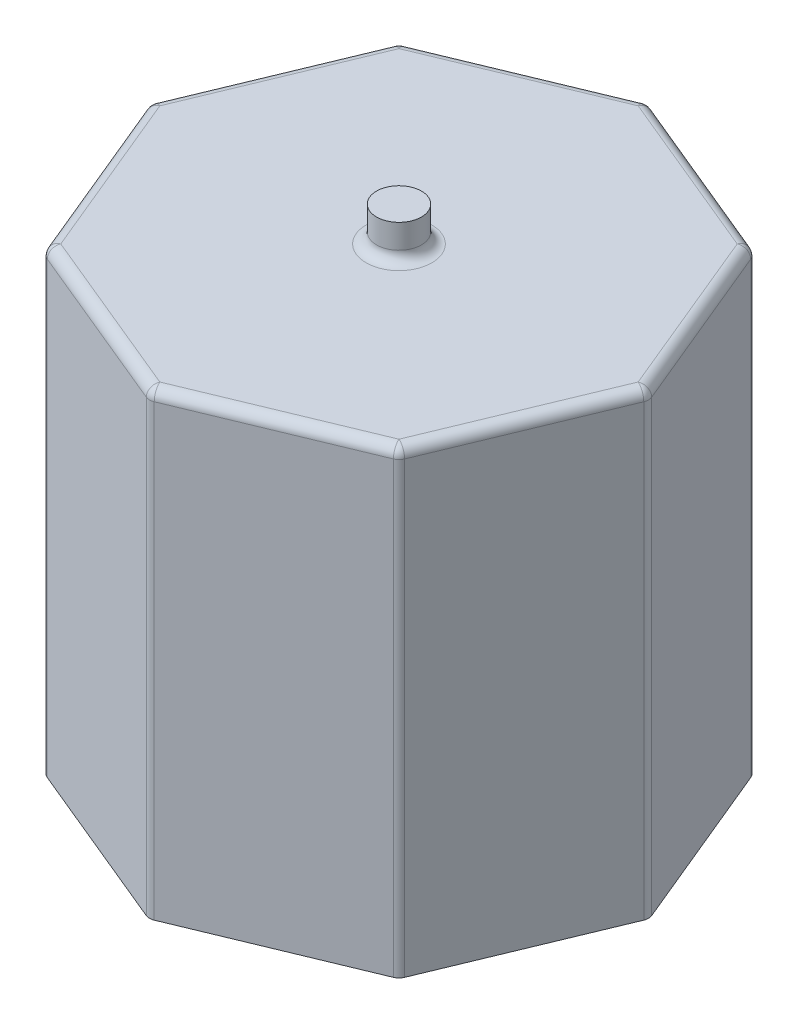
ISO-10303-21;
HEADER;
FILE_DESCRIPTION(('STEP AP214'),'2;1');
FILE_NAME('part.step','',(''),(''),'','','');
FILE_SCHEMA(('AUTOMOTIVE_DESIGN { 1 0 10303 214 1 1 1 1 }'));
ENDSEC;
DATA;
#1=APPLICATION_CONTEXT('core data for automotive mechanical design processes');
#2=APPLICATION_PROTOCOL_DEFINITION('international standard','automotive_design',2000,#1);
#3=PRODUCT_CONTEXT('',#1,'mechanical');
#4=PRODUCT('Part','Part','',(#3));
#5=PRODUCT_RELATED_PRODUCT_CATEGORY('part','',(#4));
#6=PRODUCT_DEFINITION_FORMATION('','',#4);
#7=PRODUCT_DEFINITION_CONTEXT('part definition',#1,'design');
#8=PRODUCT_DEFINITION('design','',#6,#7);
#9=PRODUCT_DEFINITION_SHAPE('','',#8);
#10=(LENGTH_UNIT() NAMED_UNIT(*) SI_UNIT(.MILLI.,.METRE.));
#11=(NAMED_UNIT(*) PLANE_ANGLE_UNIT() SI_UNIT($,.RADIAN.));
#12=(NAMED_UNIT(*) SI_UNIT($,.STERADIAN.) SOLID_ANGLE_UNIT());
#13=UNCERTAINTY_MEASURE_WITH_UNIT(LENGTH_MEASURE(1.E-05),#10,'distance_accuracy_value','');
#14=(GEOMETRIC_REPRESENTATION_CONTEXT(3) GLOBAL_UNCERTAINTY_ASSIGNED_CONTEXT((#13)) GLOBAL_UNIT_ASSIGNED_CONTEXT((#10,
#11,#12)) REPRESENTATION_CONTEXT('',''));
#15=CARTESIAN_POINT('',(0.,0.,0.));
#16=DIRECTION('',(0.,0.,1.));
#17=DIRECTION('',(1.,0.,0.));
#18=AXIS2_PLACEMENT_3D('',#15,#16,#17);
#19=CARTESIAN_POINT('',(5.12652416360253,13.3,5.12652416360241));
#20=DIRECTION('',(-0.923879532511291,0.,-0.382683432365079));
#21=DIRECTION('',(-0.382683432365079,0.,0.923879532511292));
#22=AXIS2_PLACEMENT_3D('',#19,#20,#21);
#23=PLANE('',#22);
#24=DIRECTION('',(0.,-1.,0.));
#25=VECTOR('',#24,1.);
#26=CARTESIAN_POINT('',(7.20244619966567,13.3,0.114805029709439));
#27=LINE('',#26,#25);
#28=CARTESIAN_POINT('',(7.20244619966567,0.,0.11480502970944));
#29=VERTEX_POINT('',#28);
#30=CARTESIAN_POINT('',(7.20244619966567,13.,0.114805029709439));
#31=VERTEX_POINT('',#30);
#32=EDGE_CURVE('E247',#29,#31,#27,.F.);
#33=ORIENTED_EDGE('',*,*,#32,.T.);
#34=DIRECTION('',(0.382683432365079,0.,-0.923879532511292));
#35=VECTOR('',#34,1.);
#36=CARTESIAN_POINT('',(5.17407796393686,13.,5.01171913389288));
#37=LINE('',#36,#35);
#38=CARTESIAN_POINT('',(5.17407796393686,13.,5.01171913389288));
#39=VERTEX_POINT('',#38);
#40=EDGE_CURVE('E278',#31,#39,#37,.F.);
#41=ORIENTED_EDGE('',*,*,#40,.T.);
#42=DIRECTION('',(0.,-1.,0.));
#43=VECTOR('',#42,1.);
#44=CARTESIAN_POINT('',(5.17407796393686,13.3,5.01171913389288));
#45=LINE('',#44,#43);
#46=CARTESIAN_POINT('',(5.17407796393686,0.,5.01171913389288));
#47=VERTEX_POINT('',#46);
#48=EDGE_CURVE('E245',#39,#47,#45,.T.);
#49=ORIENTED_EDGE('',*,*,#48,.T.);
#50=DIRECTION('',(0.382683432365079,0.,-0.923879532511291));
#51=VECTOR('',#50,1.);
#52=CARTESIAN_POINT('',(5.12652416360253,0.,5.12652416360241));
#53=LINE('',#52,#51);
#54=EDGE_CURVE('E357',#47,#29,#53,.T.);
#55=ORIENTED_EDGE('',*,*,#54,.T.);
#56=EDGE_LOOP('',(#33,#41,#49,#55));
#57=FACE_BOUND('',#56,.T.);
#58=ADVANCED_FACE('F35',(#57),#23,.F.);
#59=CARTESIAN_POINT('',(7.25,13.3,0.));
#60=DIRECTION('',(-0.923879532511282,0.,0.382683432365101));
#61=DIRECTION('',(0.382683432365101,0.,0.923879532511282));
#62=AXIS2_PLACEMENT_3D('',#59,#60,#61);
#63=PLANE('',#62);
#64=DIRECTION('',(0.,-1.,0.));
#65=VECTOR('',#64,1.);
#66=CARTESIAN_POINT('',(5.17407796393674,13.3,-5.01171913389301));
#67=LINE('',#66,#65);
#68=CARTESIAN_POINT('',(5.17407796393674,0.,-5.011719133893));
#69=VERTEX_POINT('',#68);
#70=CARTESIAN_POINT('',(5.17407796393674,13.,-5.01171913389301));
#71=VERTEX_POINT('',#70);
#72=EDGE_CURVE('E243',#69,#71,#67,.F.);
#73=ORIENTED_EDGE('',*,*,#72,.T.);
#74=DIRECTION('',(-0.382683432365101,0.,-0.923879532511282));
#75=VECTOR('',#74,1.);
#76=CARTESIAN_POINT('',(7.20244619966567,13.,-0.114805029709614));
#77=LINE('',#76,#75);
#78=CARTESIAN_POINT('',(7.20244619966567,13.,-0.114805029709615));
#79=VERTEX_POINT('',#78);
#80=EDGE_CURVE('E11',#71,#79,#77,.F.);
#81=ORIENTED_EDGE('',*,*,#80,.T.);
#82=DIRECTION('',(0.,-1.,0.));
#83=VECTOR('',#82,1.);
#84=CARTESIAN_POINT('',(7.20244619966567,13.3,-0.114805029709615));
#85=LINE('',#84,#83);
#86=CARTESIAN_POINT('',(7.20244619966567,0.,-0.114805029709615));
#87=VERTEX_POINT('',#86);
#88=EDGE_CURVE('E241',#79,#87,#85,.T.);
#89=ORIENTED_EDGE('',*,*,#88,.T.);
#90=DIRECTION('',(-0.382683432365101,0.,-0.923879532511282));
#91=VECTOR('',#90,1.);
#92=CARTESIAN_POINT('',(7.25,0.,0.));
#93=LINE('',#92,#91);
#94=EDGE_CURVE('E362',#87,#69,#93,.T.);
#95=ORIENTED_EDGE('',*,*,#94,.T.);
#96=EDGE_LOOP('',(#73,#81,#89,#95));
#97=FACE_BOUND('',#96,.T.);
#98=ADVANCED_FACE('F411',(#97),#63,.F.);
#99=CARTESIAN_POINT('',(5.12652416360241,13.3,-5.12652416360253));
#100=DIRECTION('',(-0.382683432365078,0.,0.923879532511291));
#101=DIRECTION('',(0.923879532511291,0.,0.382683432365078));
#102=AXIS2_PLACEMENT_3D('',#99,#100,#101);
#103=PLANE('',#102);
#104=DIRECTION('',(0.,-1.,0.));
#105=VECTOR('',#104,1.);
#106=CARTESIAN_POINT('',(0.114805029709439,13.3,-7.20244619966567));
#107=LINE('',#106,#105);
#108=CARTESIAN_POINT('',(0.114805029709439,0.,-7.20244619966567));
#109=VERTEX_POINT('',#108);
#110=CARTESIAN_POINT('',(0.114805029709439,13.,-7.20244619966567));
#111=VERTEX_POINT('',#110);
#112=EDGE_CURVE('E239',#109,#111,#107,.F.);
#113=ORIENTED_EDGE('',*,*,#112,.T.);
#114=DIRECTION('',(-0.923879532511291,0.,-0.382683432365078));
#115=VECTOR('',#114,1.);
#116=CARTESIAN_POINT('',(5.01171913389288,13.,-5.17407796393686));
#117=LINE('',#116,#115);
#118=CARTESIAN_POINT('',(5.01171913389288,13.,-5.17407796393686));
#119=VERTEX_POINT('',#118);
#120=EDGE_CURVE('E60',#111,#119,#117,.F.);
#121=ORIENTED_EDGE('',*,*,#120,.T.);
#122=DIRECTION('',(0.,-1.,0.));
#123=VECTOR('',#122,1.);
#124=CARTESIAN_POINT('',(5.01171913389288,13.3,-5.17407796393686));
#125=LINE('',#124,#123);
#126=CARTESIAN_POINT('',(5.01171913389288,0.,-5.17407796393686));
#127=VERTEX_POINT('',#126);
#128=EDGE_CURVE('E237',#119,#127,#125,.T.);
#129=ORIENTED_EDGE('',*,*,#128,.T.);
#130=DIRECTION('',(-0.923879532511291,0.,-0.382683432365078));
#131=VECTOR('',#130,1.);
#132=CARTESIAN_POINT('',(5.12652416360241,0.,-5.12652416360253));
#133=LINE('',#132,#131);
#134=EDGE_CURVE('E367',#127,#109,#133,.T.);
#135=ORIENTED_EDGE('',*,*,#134,.T.);
#136=EDGE_LOOP('',(#113,#121,#129,#135));
#137=FACE_BOUND('',#136,.T.);
#138=ADVANCED_FACE('F404',(#137),#103,.F.);
#139=CARTESIAN_POINT('',(0.,13.3,-7.25));
#140=DIRECTION('',(0.382683432365101,0.,0.923879532511282));
#141=DIRECTION('',(0.923879532511282,0.,-0.382683432365101));
#142=AXIS2_PLACEMENT_3D('',#139,#140,#141);
#143=PLANE('',#142);
#144=DIRECTION('',(0.,-1.,0.));
#145=VECTOR('',#144,1.);
#146=CARTESIAN_POINT('',(-5.011719133893,13.3,-5.17407796393674));
#147=LINE('',#146,#145);
#148=CARTESIAN_POINT('',(-5.011719133893,0.,-5.17407796393674));
#149=VERTEX_POINT('',#148);
#150=CARTESIAN_POINT('',(-5.011719133893,13.,-5.17407796393674));
#151=VERTEX_POINT('',#150);
#152=EDGE_CURVE('E234',#149,#151,#147,.F.);
#153=ORIENTED_EDGE('',*,*,#152,.T.);
#154=DIRECTION('',(-0.923879532511282,0.,0.382683432365101));
#155=VECTOR('',#154,1.);
#156=CARTESIAN_POINT('',(-0.114805029709614,13.,-7.20244619966567));
#157=LINE('',#156,#155);
#158=CARTESIAN_POINT('',(-0.114805029709615,13.,-7.20244619966567));
#159=VERTEX_POINT('',#158);
#160=EDGE_CURVE('E297',#151,#159,#157,.F.);
#161=ORIENTED_EDGE('',*,*,#160,.T.);
#162=DIRECTION('',(0.,-1.,0.));
#163=VECTOR('',#162,1.);
#164=CARTESIAN_POINT('',(-0.114805029709615,13.3,-7.20244619966567));
#165=LINE('',#164,#163);
#166=CARTESIAN_POINT('',(-0.114805029709615,0.,-7.20244619966567));
#167=VERTEX_POINT('',#166);
#168=EDGE_CURVE('E232',#159,#167,#165,.T.);
#169=ORIENTED_EDGE('',*,*,#168,.T.);
#170=DIRECTION('',(-0.923879532511282,0.,0.382683432365101));
#171=VECTOR('',#170,1.);
#172=CARTESIAN_POINT('',(0.,0.,-7.25));
#173=LINE('',#172,#171);
#174=EDGE_CURVE('E370',#167,#149,#173,.T.);
#175=ORIENTED_EDGE('',*,*,#174,.T.);
#176=EDGE_LOOP('',(#153,#161,#169,#175));
#177=FACE_BOUND('',#176,.T.);
#178=ADVANCED_FACE('F394',(#177),#143,.F.);
#179=CARTESIAN_POINT('',(-5.12652416360253,13.3,-5.12652416360241));
#180=DIRECTION('',(0.923879532511291,0.,0.382683432365079));
#181=DIRECTION('',(0.382683432365079,0.,-0.923879532511291));
#182=AXIS2_PLACEMENT_3D('',#179,#180,#181);
#183=PLANE('',#182);
#184=DIRECTION('',(0.,-1.,0.));
#185=VECTOR('',#184,1.);
#186=CARTESIAN_POINT('',(-7.20244619966567,13.3,-0.11480502970944));
#187=LINE('',#186,#185);
#188=CARTESIAN_POINT('',(-7.20244619966567,0.,-0.11480502970944));
#189=VERTEX_POINT('',#188);
#190=CARTESIAN_POINT('',(-7.20244619966567,13.,-0.11480502970944));
#191=VERTEX_POINT('',#190);
#192=EDGE_CURVE('E229',#189,#191,#187,.F.);
#193=ORIENTED_EDGE('',*,*,#192,.T.);
#194=DIRECTION('',(-0.382683432365079,0.,0.923879532511291));
#195=VECTOR('',#194,1.);
#196=CARTESIAN_POINT('',(-5.17407796393686,13.,-5.01171913389288));
#197=LINE('',#196,#195);
#198=CARTESIAN_POINT('',(-5.17407796393686,13.,-5.01171913389288));
#199=VERTEX_POINT('',#198);
#200=EDGE_CURVE('E293',#191,#199,#197,.F.);
#201=ORIENTED_EDGE('',*,*,#200,.T.);
#202=DIRECTION('',(0.,-1.,0.));
#203=VECTOR('',#202,1.);
#204=CARTESIAN_POINT('',(-5.17407796393686,13.3,-5.01171913389288));
#205=LINE('',#204,#203);
#206=CARTESIAN_POINT('',(-5.17407796393686,0.,-5.01171913389288));
#207=VERTEX_POINT('',#206);
#208=EDGE_CURVE('E227',#199,#207,#205,.T.);
#209=ORIENTED_EDGE('',*,*,#208,.T.);
#210=DIRECTION('',(-0.382683432365079,0.,0.923879532511291));
#211=VECTOR('',#210,1.);
#212=CARTESIAN_POINT('',(-5.12652416360253,0.,-5.12652416360241));
#213=LINE('',#212,#211);
#214=EDGE_CURVE('E208',#207,#189,#213,.T.);
#215=ORIENTED_EDGE('',*,*,#214,.T.);
#216=EDGE_LOOP('',(#193,#201,#209,#215));
#217=FACE_BOUND('',#216,.T.);
#218=ADVANCED_FACE('F376',(#217),#183,.F.);
#219=CARTESIAN_POINT('',(-7.25,13.3,0.));
#220=DIRECTION('',(0.923879532511282,0.,-0.382683432365101));
#221=DIRECTION('',(-0.382683432365101,0.,-0.923879532511282));
#222=AXIS2_PLACEMENT_3D('',#219,#220,#221);
#223=PLANE('',#222);
#224=DIRECTION('',(0.,-1.,0.));
#225=VECTOR('',#224,1.);
#226=CARTESIAN_POINT('',(-5.17407796393674,13.3,5.011719133893));
#227=LINE('',#226,#225);
#228=CARTESIAN_POINT('',(-5.17407796393674,0.,5.011719133893));
#229=VERTEX_POINT('',#228);
#230=CARTESIAN_POINT('',(-5.17407796393674,13.,5.011719133893));
#231=VERTEX_POINT('',#230);
#232=EDGE_CURVE('E193',#229,#231,#227,.F.);
#233=ORIENTED_EDGE('',*,*,#232,.T.);
#234=DIRECTION('',(0.382683432365101,0.,0.923879532511282));
#235=VECTOR('',#234,1.);
#236=CARTESIAN_POINT('',(-7.20244619966567,13.,0.114805029709614));
#237=LINE('',#236,#235);
#238=CARTESIAN_POINT('',(-7.20244619966567,13.,0.114805029709614));
#239=VERTEX_POINT('',#238);
#240=EDGE_CURVE('E289',#231,#239,#237,.F.);
#241=ORIENTED_EDGE('',*,*,#240,.T.);
#242=DIRECTION('',(0.,-1.,0.));
#243=VECTOR('',#242,1.);
#244=CARTESIAN_POINT('',(-7.20244619966567,13.3,0.114805029709614));
#245=LINE('',#244,#243);
#246=CARTESIAN_POINT('',(-7.20244619966567,0.,0.114805029709614));
#247=VERTEX_POINT('',#246);
#248=EDGE_CURVE('E197',#239,#247,#245,.T.);
#249=ORIENTED_EDGE('',*,*,#248,.T.);
#250=DIRECTION('',(0.382683432365101,0.,0.923879532511282));
#251=VECTOR('',#250,1.);
#252=CARTESIAN_POINT('',(-7.25,0.,0.));
#253=LINE('',#252,#251);
#254=EDGE_CURVE('E204',#247,#229,#253,.T.);
#255=ORIENTED_EDGE('',*,*,#254,.T.);
#256=EDGE_LOOP('',(#233,#241,#249,#255));
#257=FACE_BOUND('',#256,.T.);
#258=ADVANCED_FACE('F457',(#257),#223,.F.);
#259=CARTESIAN_POINT('',(-5.12652416360241,13.3,5.12652416360253));
#260=DIRECTION('',(0.382683432365079,0.,-0.923879532511291));
#261=DIRECTION('',(-0.923879532511291,0.,-0.382683432365079));
#262=AXIS2_PLACEMENT_3D('',#259,#260,#261);
#263=PLANE('',#262);
#264=DIRECTION('',(0.,-1.,0.));
#265=VECTOR('',#264,1.);
#266=CARTESIAN_POINT('',(-0.114805029709441,13.3,7.20244619966567));
#267=LINE('',#266,#265);
#268=CARTESIAN_POINT('',(-0.114805029709441,0.,7.20244619966567));
#269=VERTEX_POINT('',#268);
#270=CARTESIAN_POINT('',(-0.114805029709441,13.,7.20244619966567));
#271=VERTEX_POINT('',#270);
#272=EDGE_CURVE('E187',#269,#271,#267,.F.);
#273=ORIENTED_EDGE('',*,*,#272,.T.);
#274=DIRECTION('',(0.923879532511291,0.,0.382683432365079));
#275=VECTOR('',#274,1.);
#276=CARTESIAN_POINT('',(-5.01171913389288,13.,5.17407796393686));
#277=LINE('',#276,#275);
#278=CARTESIAN_POINT('',(-5.01171913389288,13.,5.17407796393686));
#279=VERTEX_POINT('',#278);
#280=EDGE_CURVE('E183',#271,#279,#277,.F.);
#281=ORIENTED_EDGE('',*,*,#280,.T.);
#282=DIRECTION('',(0.,-1.,0.));
#283=VECTOR('',#282,1.);
#284=CARTESIAN_POINT('',(-5.01171913389288,13.3,5.17407796393686));
#285=LINE('',#284,#283);
#286=CARTESIAN_POINT('',(-5.01171913389288,0.,5.17407796393686));
#287=VERTEX_POINT('',#286);
#288=EDGE_CURVE('E175',#279,#287,#285,.T.);
#289=ORIENTED_EDGE('',*,*,#288,.T.);
#290=DIRECTION('',(0.923879532511291,0.,0.382683432365079));
#291=VECTOR('',#290,1.);
#292=CARTESIAN_POINT('',(-5.12652416360241,0.,5.12652416360253));
#293=LINE('',#292,#291);
#294=EDGE_CURVE('E180',#287,#269,#293,.T.);
#295=ORIENTED_EDGE('',*,*,#294,.T.);
#296=EDGE_LOOP('',(#273,#281,#289,#295));
#297=FACE_BOUND('',#296,.T.);
#298=ADVANCED_FACE('F178',(#297),#263,.F.);
#299=CARTESIAN_POINT('',(0.,13.3,7.25));
#300=DIRECTION('',(-0.382683432365101,0.,-0.923879532511282));
#301=DIRECTION('',(-0.923879532511282,0.,0.382683432365101));
#302=AXIS2_PLACEMENT_3D('',#299,#300,#301);
#303=PLANE('',#302);
#304=DIRECTION('',(0.,-1.,0.));
#305=VECTOR('',#304,1.);
#306=CARTESIAN_POINT('',(5.011719133893,13.3,5.17407796393674));
#307=LINE('',#306,#305);
#308=CARTESIAN_POINT('',(5.011719133893,0.,5.17407796393674));
#309=VERTEX_POINT('',#308);
#310=CARTESIAN_POINT('',(5.011719133893,13.,5.17407796393674));
#311=VERTEX_POINT('',#310);
#312=EDGE_CURVE('E252',#309,#311,#307,.F.);
#313=ORIENTED_EDGE('',*,*,#312,.T.);
#314=DIRECTION('',(0.923879532511282,0.,-0.382683432365101));
#315=VECTOR('',#314,1.);
#316=CARTESIAN_POINT('',(0.114805029709614,13.,7.20244619966567));
#317=LINE('',#316,#315);
#318=CARTESIAN_POINT('',(0.114805029709614,13.,7.20244619966567));
#319=VERTEX_POINT('',#318);
#320=EDGE_CURVE('E282',#311,#319,#317,.F.);
#321=ORIENTED_EDGE('',*,*,#320,.T.);
#322=DIRECTION('',(0.,-1.,0.));
#323=VECTOR('',#322,1.);
#324=CARTESIAN_POINT('',(0.114805029709614,13.3,7.20244619966567));
#325=LINE('',#324,#323);
#326=CARTESIAN_POINT('',(0.114805029709614,0.,7.20244619966567));
#327=VERTEX_POINT('',#326);
#328=EDGE_CURVE('E250',#319,#327,#325,.T.);
#329=ORIENTED_EDGE('',*,*,#328,.T.);
#330=DIRECTION('',(0.923879532511282,0.,-0.382683432365101));
#331=VECTOR('',#330,1.);
#332=CARTESIAN_POINT('',(0.,0.,7.25));
#333=LINE('',#332,#331);
#334=EDGE_CURVE('E203',#327,#309,#333,.T.);
#335=ORIENTED_EDGE('',*,*,#334,.T.);
#336=EDGE_LOOP('',(#313,#321,#329,#335));
#337=FACE_BOUND('',#336,.T.);
#338=ADVANCED_FACE('F430',(#337),#303,.F.);
#339=CARTESIAN_POINT('',(0.,13.3,0.));
#340=DIRECTION('',(0.,1.,0.));
#341=DIRECTION('',(0.,0.,1.));
#342=AXIS2_PLACEMENT_3D('',#339,#340,#341);
#343=PLANE('',#342);
#344=CARTESIAN_POINT('',(0.,13.3,0.));
#345=DIRECTION('',(0.,1.,0.));
#346=DIRECTION('',(0.,0.,1.));
#347=AXIS2_PLACEMENT_3D('',#344,#345,#346);
#348=CIRCLE('',#347,0.95);
#349=CARTESIAN_POINT('',(0.,13.3,0.95));
#350=VERTEX_POINT('',#349);
#351=EDGE_CURVE('E275',#350,#350,#348,.F.);
#352=ORIENTED_EDGE('',*,*,#351,.T.);
#353=EDGE_LOOP('',(#352));
#354=FACE_BOUND('',#353,.T.);
#355=DIRECTION('',(0.923879532511282,0.,-0.382683432365101));
#356=VECTOR('',#355,1.);
#357=CARTESIAN_POINT('',(4.89691410418347,13.3,4.89691410418336));
#358=LINE('',#357,#356);
#359=CARTESIAN_POINT('',(0.,13.3,6.92528233991228));
#360=VERTEX_POINT('',#359);
#361=CARTESIAN_POINT('',(4.89691410418347,13.3,4.89691410418336));
#362=VERTEX_POINT('',#361);
#363=EDGE_CURVE('E270',#360,#362,#358,.T.);
#364=ORIENTED_EDGE('',*,*,#363,.T.);
#365=DIRECTION('',(0.382683432365079,0.,-0.923879532511292));
#366=VECTOR('',#365,1.);
#367=CARTESIAN_POINT('',(6.92528233991228,13.3,0.));
#368=LINE('',#367,#366);
#369=CARTESIAN_POINT('',(6.92528233991228,13.3,0.));
#370=VERTEX_POINT('',#369);
#371=EDGE_CURVE('E272',#362,#370,#368,.T.);
#372=ORIENTED_EDGE('',*,*,#371,.T.);
#373=DIRECTION('',(-0.382683432365101,0.,-0.923879532511282));
#374=VECTOR('',#373,1.);
#375=CARTESIAN_POINT('',(4.89691410418336,13.3,-4.89691410418347));
#376=LINE('',#375,#374);
#377=CARTESIAN_POINT('',(4.89691410418336,13.3,-4.89691410418347));
#378=VERTEX_POINT('',#377);
#379=EDGE_CURVE('E258',#370,#378,#376,.T.);
#380=ORIENTED_EDGE('',*,*,#379,.T.);
#381=DIRECTION('',(-0.923879532511291,0.,-0.382683432365078));
#382=VECTOR('',#381,1.);
#383=CARTESIAN_POINT('',(0.,13.3,-6.92528233991228));
#384=LINE('',#383,#382);
#385=CARTESIAN_POINT('',(0.,13.3,-6.92528233991228));
#386=VERTEX_POINT('',#385);
#387=EDGE_CURVE('E260',#378,#386,#384,.T.);
#388=ORIENTED_EDGE('',*,*,#387,.T.);
#389=DIRECTION('',(-0.923879532511282,0.,0.382683432365101));
#390=VECTOR('',#389,1.);
#391=CARTESIAN_POINT('',(-4.89691410418347,13.3,-4.89691410418336));
#392=LINE('',#391,#390);
#393=CARTESIAN_POINT('',(-4.89691410418347,13.3,-4.89691410418336));
#394=VERTEX_POINT('',#393);
#395=EDGE_CURVE('E262',#386,#394,#392,.T.);
#396=ORIENTED_EDGE('',*,*,#395,.T.);
#397=DIRECTION('',(-0.382683432365079,0.,0.923879532511291));
#398=VECTOR('',#397,1.);
#399=CARTESIAN_POINT('',(-6.92528233991228,13.3,0.));
#400=LINE('',#399,#398);
#401=CARTESIAN_POINT('',(-6.92528233991228,13.3,0.));
#402=VERTEX_POINT('',#401);
#403=EDGE_CURVE('E264',#394,#402,#400,.T.);
#404=ORIENTED_EDGE('',*,*,#403,.T.);
#405=DIRECTION('',(0.382683432365101,0.,0.923879532511282));
#406=VECTOR('',#405,1.);
#407=CARTESIAN_POINT('',(-4.89691410418336,13.3,4.89691410418347));
#408=LINE('',#407,#406);
#409=CARTESIAN_POINT('',(-4.89691410418336,13.3,4.89691410418347));
#410=VERTEX_POINT('',#409);
#411=EDGE_CURVE('E266',#402,#410,#408,.T.);
#412=ORIENTED_EDGE('',*,*,#411,.T.);
#413=DIRECTION('',(0.923879532511291,0.,0.382683432365079));
#414=VECTOR('',#413,1.);
#415=CARTESIAN_POINT('',(0.,13.3,6.92528233991228));
#416=LINE('',#415,#414);
#417=EDGE_CURVE('E268',#410,#360,#416,.T.);
#418=ORIENTED_EDGE('',*,*,#417,.T.);
#419=EDGE_LOOP('',(#364,#372,#380,#388,#396,#404,#412,#418));
#420=FACE_BOUND('',#419,.T.);
#421=ADVANCED_FACE('F450',(#354,#420),#343,.T.);
#422=CARTESIAN_POINT('',(0.,0.,0.));
#423=DIRECTION('',(0.,1.,0.));
#424=DIRECTION('',(0.,0.,1.));
#425=AXIS2_PLACEMENT_3D('',#422,#423,#424);
#426=PLANE('',#425);
#427=ORIENTED_EDGE('',*,*,#294,.F.);
#428=CARTESIAN_POINT('',(-4.89691410418336,0.,4.89691410418347));
#429=DIRECTION('',(0.,1.,0.));
#430=DIRECTION('',(0.,0.,1.));
#431=AXIS2_PLACEMENT_3D('',#428,#429,#430);
#432=CIRCLE('',#431,0.3);
#433=EDGE_CURVE('E190',#287,#229,#432,.F.);
#434=ORIENTED_EDGE('',*,*,#433,.T.);
#435=ORIENTED_EDGE('',*,*,#254,.F.);
#436=CARTESIAN_POINT('',(-6.92528233991228,0.,0.));
#437=DIRECTION('',(0.,1.,0.));
#438=DIRECTION('',(0.,0.,1.));
#439=AXIS2_PLACEMENT_3D('',#436,#437,#438);
#440=CIRCLE('',#439,0.3);
#441=EDGE_CURVE('E198',#247,#189,#440,.F.);
#442=ORIENTED_EDGE('',*,*,#441,.T.);
#443=ORIENTED_EDGE('',*,*,#214,.F.);
#444=CARTESIAN_POINT('',(-4.89691410418347,0.,-4.89691410418336));
#445=DIRECTION('',(0.,1.,0.));
#446=DIRECTION('',(0.,0.,1.));
#447=AXIS2_PLACEMENT_3D('',#444,#445,#446);
#448=CIRCLE('',#447,0.3);
#449=EDGE_CURVE('E222',#207,#149,#448,.F.);
#450=ORIENTED_EDGE('',*,*,#449,.T.);
#451=ORIENTED_EDGE('',*,*,#174,.F.);
#452=CARTESIAN_POINT('',(0.,0.,-6.92528233991228));
#453=DIRECTION('',(0.,1.,0.));
#454=DIRECTION('',(0.,0.,1.));
#455=AXIS2_PLACEMENT_3D('',#452,#453,#454);
#456=CIRCLE('',#455,0.3);
#457=EDGE_CURVE('E220',#167,#109,#456,.F.);
#458=ORIENTED_EDGE('',*,*,#457,.T.);
#459=ORIENTED_EDGE('',*,*,#134,.F.);
#460=CARTESIAN_POINT('',(4.89691410418336,0.,-4.89691410418347));
#461=DIRECTION('',(0.,1.,0.));
#462=DIRECTION('',(0.,0.,1.));
#463=AXIS2_PLACEMENT_3D('',#460,#461,#462);
#464=CIRCLE('',#463,0.3);
#465=EDGE_CURVE('E218',#127,#69,#464,.F.);
#466=ORIENTED_EDGE('',*,*,#465,.T.);
#467=ORIENTED_EDGE('',*,*,#94,.F.);
#468=CARTESIAN_POINT('',(6.92528233991228,0.,0.));
#469=DIRECTION('',(0.,1.,0.));
#470=DIRECTION('',(0.,0.,1.));
#471=AXIS2_PLACEMENT_3D('',#468,#469,#470);
#472=CIRCLE('',#471,0.3);
#473=EDGE_CURVE('E216',#87,#29,#472,.F.);
#474=ORIENTED_EDGE('',*,*,#473,.T.);
#475=ORIENTED_EDGE('',*,*,#54,.F.);
#476=CARTESIAN_POINT('',(4.89691410418347,0.,4.89691410418336));
#477=DIRECTION('',(0.,1.,0.));
#478=DIRECTION('',(0.,0.,1.));
#479=AXIS2_PLACEMENT_3D('',#476,#477,#478);
#480=CIRCLE('',#479,0.3);
#481=EDGE_CURVE('E214',#47,#309,#480,.F.);
#482=ORIENTED_EDGE('',*,*,#481,.T.);
#483=ORIENTED_EDGE('',*,*,#334,.F.);
#484=CARTESIAN_POINT('',(0.,0.,6.92528233991228));
#485=DIRECTION('',(0.,1.,0.));
#486=DIRECTION('',(0.,0.,1.));
#487=AXIS2_PLACEMENT_3D('',#484,#485,#486);
#488=CIRCLE('',#487,0.3);
#489=EDGE_CURVE('E186',#327,#269,#488,.F.);
#490=ORIENTED_EDGE('',*,*,#489,.T.);
#491=EDGE_LOOP('',(#427,#434,#435,#442,#443,#450,#451,#458,#459,#466,#467,#474,#475,#482,#483,#490));
#492=FACE_BOUND('',#491,.T.);
#493=ADVANCED_FACE('F200',(#492),#426,.F.);
#494=CARTESIAN_POINT('',(0.,14.3,0.));
#495=DIRECTION('',(0.,-1.,0.));
#496=DIRECTION('',(0.,0.,-1.));
#497=AXIS2_PLACEMENT_3D('',#494,#495,#496);
#498=CYLINDRICAL_SURFACE('',#497,0.65);
#499=CARTESIAN_POINT('',(0.,13.6,0.));
#500=DIRECTION('',(0.,1.,0.));
#501=DIRECTION('',(0.,0.,1.));
#502=AXIS2_PLACEMENT_3D('',#499,#500,#501);
#503=CIRCLE('',#502,0.65);
#504=CARTESIAN_POINT('',(0.,13.6,0.65));
#505=VERTEX_POINT('',#504);
#506=EDGE_CURVE('E44',#505,#505,#503,.T.);
#507=ORIENTED_EDGE('',*,*,#506,.T.);
#508=EDGE_LOOP('',(#507));
#509=FACE_BOUND('',#508,.T.);
#510=CARTESIAN_POINT('',(0.,14.3,0.));
#511=DIRECTION('',(0.,1.,0.));
#512=DIRECTION('',(0.,0.,1.));
#513=AXIS2_PLACEMENT_3D('',#510,#511,#512);
#514=CIRCLE('',#513,0.65);
#515=CARTESIAN_POINT('',(0.,14.3,0.65));
#516=VERTEX_POINT('',#515);
#517=EDGE_CURVE('E352',#516,#516,#514,.T.);
#518=ORIENTED_EDGE('',*,*,#517,.F.);
#519=EDGE_LOOP('',(#518));
#520=FACE_BOUND('',#519,.T.);
#521=ADVANCED_FACE('F707',(#509,#520),#498,.T.);
#522=CARTESIAN_POINT('',(0.,14.3,0.));
#523=DIRECTION('',(0.,1.,0.));
#524=DIRECTION('',(0.,0.,1.));
#525=AXIS2_PLACEMENT_3D('',#522,#523,#524);
#526=PLANE('',#525);
#527=ORIENTED_EDGE('',*,*,#517,.T.);
#528=EDGE_LOOP('',(#527));
#529=FACE_BOUND('',#528,.T.);
#530=ADVANCED_FACE('F476',(#529),#526,.T.);
#531=CARTESIAN_POINT('',(-4.89691410418336,13.3,4.89691410418347));
#532=DIRECTION('',(0.,-1.,0.));
#533=DIRECTION('',(0.,0.,-1.));
#534=AXIS2_PLACEMENT_3D('',#531,#532,#533);
#535=CYLINDRICAL_SURFACE('',#534,0.3);
#536=ORIENTED_EDGE('',*,*,#288,.F.);
#537=CARTESIAN_POINT('',(-4.89691410418336,13.,4.89691410418347));
#538=DIRECTION('',(0.,-1.,0.));
#539=DIRECTION('',(0.,0.,-1.));
#540=AXIS2_PLACEMENT_3D('',#537,#538,#539);
#541=CIRCLE('',#540,0.3);
#542=EDGE_CURVE('E287',#279,#231,#541,.T.);
#543=ORIENTED_EDGE('',*,*,#542,.T.);
#544=ORIENTED_EDGE('',*,*,#232,.F.);
#545=ORIENTED_EDGE('',*,*,#433,.F.);
#546=EDGE_LOOP('',(#536,#543,#544,#545));
#547=FACE_BOUND('',#546,.T.);
#548=ADVANCED_FACE('F191',(#547),#535,.T.);
#549=CARTESIAN_POINT('',(-6.92528233991228,13.3,0.));
#550=DIRECTION('',(0.,-1.,0.));
#551=DIRECTION('',(0.,0.,-1.));
#552=AXIS2_PLACEMENT_3D('',#549,#550,#551);
#553=CYLINDRICAL_SURFACE('',#552,0.3);
#554=ORIENTED_EDGE('',*,*,#248,.F.);
#555=CARTESIAN_POINT('',(-6.92528233991228,13.,0.));
#556=DIRECTION('',(0.,-1.,0.));
#557=DIRECTION('',(0.,0.,-1.));
#558=AXIS2_PLACEMENT_3D('',#555,#556,#557);
#559=CIRCLE('',#558,0.3);
#560=EDGE_CURVE('E291',#239,#191,#559,.T.);
#561=ORIENTED_EDGE('',*,*,#560,.T.);
#562=ORIENTED_EDGE('',*,*,#192,.F.);
#563=ORIENTED_EDGE('',*,*,#441,.F.);
#564=EDGE_LOOP('',(#554,#561,#562,#563));
#565=FACE_BOUND('',#564,.T.);
#566=ADVANCED_FACE('F382',(#565),#553,.T.);
#567=CARTESIAN_POINT('',(-4.89691410418347,13.3,-4.89691410418336));
#568=DIRECTION('',(0.,-1.,0.));
#569=DIRECTION('',(0.,0.,-1.));
#570=AXIS2_PLACEMENT_3D('',#567,#568,#569);
#571=CYLINDRICAL_SURFACE('',#570,0.3);
#572=ORIENTED_EDGE('',*,*,#208,.F.);
#573=CARTESIAN_POINT('',(-4.89691410418347,13.,-4.89691410418336));
#574=DIRECTION('',(0.,-1.,0.));
#575=DIRECTION('',(0.,0.,-1.));
#576=AXIS2_PLACEMENT_3D('',#573,#574,#575);
#577=CIRCLE('',#576,0.3);
#578=EDGE_CURVE('E295',#199,#151,#577,.T.);
#579=ORIENTED_EDGE('',*,*,#578,.T.);
#580=ORIENTED_EDGE('',*,*,#152,.F.);
#581=ORIENTED_EDGE('',*,*,#449,.F.);
#582=EDGE_LOOP('',(#572,#579,#580,#581));
#583=FACE_BOUND('',#582,.T.);
#584=ADVANCED_FACE('F390',(#583),#571,.T.);
#585=CARTESIAN_POINT('',(0.,13.3,-6.92528233991228));
#586=DIRECTION('',(0.,-1.,0.));
#587=DIRECTION('',(0.,0.,-1.));
#588=AXIS2_PLACEMENT_3D('',#585,#586,#587);
#589=CYLINDRICAL_SURFACE('',#588,0.3);
#590=ORIENTED_EDGE('',*,*,#168,.F.);
#591=CARTESIAN_POINT('',(0.,13.,-6.92528233991228));
#592=DIRECTION('',(0.,-1.,0.));
#593=DIRECTION('',(0.,0.,-1.));
#594=AXIS2_PLACEMENT_3D('',#591,#592,#593);
#595=CIRCLE('',#594,0.3);
#596=EDGE_CURVE('E299',#159,#111,#595,.T.);
#597=ORIENTED_EDGE('',*,*,#596,.T.);
#598=ORIENTED_EDGE('',*,*,#112,.F.);
#599=ORIENTED_EDGE('',*,*,#457,.F.);
#600=EDGE_LOOP('',(#590,#597,#598,#599));
#601=FACE_BOUND('',#600,.T.);
#602=ADVANCED_FACE('F402',(#601),#589,.T.);
#603=CARTESIAN_POINT('',(4.89691410418336,13.3,-4.89691410418347));
#604=DIRECTION('',(0.,-1.,0.));
#605=DIRECTION('',(0.,0.,-1.));
#606=AXIS2_PLACEMENT_3D('',#603,#604,#605);
#607=CYLINDRICAL_SURFACE('',#606,0.3);
#608=ORIENTED_EDGE('',*,*,#128,.F.);
#609=CARTESIAN_POINT('',(4.89691410418336,13.,-4.89691410418347));
#610=DIRECTION('',(0.,-1.,0.));
#611=DIRECTION('',(0.,0.,-1.));
#612=AXIS2_PLACEMENT_3D('',#609,#610,#611);
#613=CIRCLE('',#612,0.3);
#614=EDGE_CURVE('E52',#119,#71,#613,.T.);
#615=ORIENTED_EDGE('',*,*,#614,.T.);
#616=ORIENTED_EDGE('',*,*,#72,.F.);
#617=ORIENTED_EDGE('',*,*,#465,.F.);
#618=EDGE_LOOP('',(#608,#615,#616,#617));
#619=FACE_BOUND('',#618,.T.);
#620=ADVANCED_FACE('F408',(#619),#607,.T.);
#621=CARTESIAN_POINT('',(6.92528233991228,13.3,0.));
#622=DIRECTION('',(0.,-1.,0.));
#623=DIRECTION('',(0.,0.,-1.));
#624=AXIS2_PLACEMENT_3D('',#621,#622,#623);
#625=CYLINDRICAL_SURFACE('',#624,0.3);
#626=ORIENTED_EDGE('',*,*,#88,.F.);
#627=CARTESIAN_POINT('',(6.92528233991228,13.,0.));
#628=DIRECTION('',(0.,-1.,0.));
#629=DIRECTION('',(0.,0.,-1.));
#630=AXIS2_PLACEMENT_3D('',#627,#628,#629);
#631=CIRCLE('',#630,0.3);
#632=EDGE_CURVE('E255',#79,#31,#631,.T.);
#633=ORIENTED_EDGE('',*,*,#632,.T.);
#634=ORIENTED_EDGE('',*,*,#32,.F.);
#635=ORIENTED_EDGE('',*,*,#473,.F.);
#636=EDGE_LOOP('',(#626,#633,#634,#635));
#637=FACE_BOUND('',#636,.T.);
#638=ADVANCED_FACE('F419',(#637),#625,.T.);
#639=CARTESIAN_POINT('',(4.89691410418347,13.3,4.89691410418336));
#640=DIRECTION('',(0.,-1.,0.));
#641=DIRECTION('',(0.,0.,-1.));
#642=AXIS2_PLACEMENT_3D('',#639,#640,#641);
#643=CYLINDRICAL_SURFACE('',#642,0.3);
#644=ORIENTED_EDGE('',*,*,#48,.F.);
#645=CARTESIAN_POINT('',(4.89691410418347,13.,4.89691410418336));
#646=DIRECTION('',(0.,-1.,0.));
#647=DIRECTION('',(0.,0.,-1.));
#648=AXIS2_PLACEMENT_3D('',#645,#646,#647);
#649=CIRCLE('',#648,0.3);
#650=EDGE_CURVE('E280',#39,#311,#649,.T.);
#651=ORIENTED_EDGE('',*,*,#650,.T.);
#652=ORIENTED_EDGE('',*,*,#312,.F.);
#653=ORIENTED_EDGE('',*,*,#481,.F.);
#654=EDGE_LOOP('',(#644,#651,#652,#653));
#655=FACE_BOUND('',#654,.T.);
#656=ADVANCED_FACE('F428',(#655),#643,.T.);
#657=CARTESIAN_POINT('',(0.,13.3,6.92528233991228));
#658=DIRECTION('',(0.,-1.,0.));
#659=DIRECTION('',(0.,0.,-1.));
#660=AXIS2_PLACEMENT_3D('',#657,#658,#659);
#661=CYLINDRICAL_SURFACE('',#660,0.3);
#662=ORIENTED_EDGE('',*,*,#328,.F.);
#663=CARTESIAN_POINT('',(0.,13.,6.92528233991228));
#664=DIRECTION('',(0.,-1.,0.));
#665=DIRECTION('',(0.,0.,-1.));
#666=AXIS2_PLACEMENT_3D('',#663,#664,#665);
#667=CIRCLE('',#666,0.3);
#668=EDGE_CURVE('E284',#319,#271,#667,.T.);
#669=ORIENTED_EDGE('',*,*,#668,.T.);
#670=ORIENTED_EDGE('',*,*,#272,.F.);
#671=ORIENTED_EDGE('',*,*,#489,.F.);
#672=EDGE_LOOP('',(#662,#669,#670,#671));
#673=FACE_BOUND('',#672,.T.);
#674=ADVANCED_FACE('F435',(#673),#661,.T.);
#675=CARTESIAN_POINT('',(-6.92528233991228,13.,0.));
#676=DIRECTION('',(0.,1.,0.));
#677=DIRECTION('',(0.,0.,1.));
#678=AXIS2_PLACEMENT_3D('',#675,#676,#677);
#679=SPHERICAL_SURFACE('',#678,0.3);
#680=CARTESIAN_POINT('',(-6.92528233991228,13.,0.));
#681=DIRECTION('',(0.382683432365077,0.,-0.923879532511292));
#682=DIRECTION('',(-0.923879532511292,0.,-0.382683432365077));
#683=AXIS2_PLACEMENT_3D('',#680,#681,#682);
#684=CIRCLE('',#683,0.3);
#685=EDGE_CURVE('E344',#191,#402,#684,.T.);
#686=ORIENTED_EDGE('',*,*,#685,.F.);
#687=ORIENTED_EDGE('',*,*,#560,.F.);
#688=CARTESIAN_POINT('',(-6.92528233991228,13.,0.));
#689=DIRECTION('',(0.382683432365102,0.,0.923879532511282));
#690=DIRECTION('',(0.923879532511282,0.,-0.382683432365102));
#691=AXIS2_PLACEMENT_3D('',#688,#689,#690);
#692=CIRCLE('',#691,0.3);
#693=EDGE_CURVE('E39',#402,#239,#692,.T.);
#694=ORIENTED_EDGE('',*,*,#693,.F.);
#695=EDGE_LOOP('',(#686,#687,#694));
#696=FACE_BOUND('',#695,.T.);
#697=ADVANCED_FACE('F385',(#696),#679,.T.);
#698=CARTESIAN_POINT('',(-5.91109822204782,13.,2.44845705209178));
#699=DIRECTION('',(-0.382683432365101,0.,-0.923879532511282));
#700=DIRECTION('',(-0.923879532511282,0.,0.382683432365101));
#701=AXIS2_PLACEMENT_3D('',#698,#699,#700);
#702=CYLINDRICAL_SURFACE('',#701,0.3);
#703=ORIENTED_EDGE('',*,*,#693,.T.);
#704=ORIENTED_EDGE('',*,*,#240,.F.);
#705=CARTESIAN_POINT('',(-4.89691410418336,13.,4.89691410418347));
#706=DIRECTION('',(0.382683432365104,0.,0.923879532511281));
#707=DIRECTION('',(0.923879532511281,0.,-0.382683432365104));
#708=AXIS2_PLACEMENT_3D('',#705,#706,#707);
#709=CIRCLE('',#708,0.3);
#710=EDGE_CURVE('E342',#410,#231,#709,.T.);
#711=ORIENTED_EDGE('',*,*,#710,.F.);
#712=ORIENTED_EDGE('',*,*,#411,.F.);
#713=EDGE_LOOP('',(#703,#704,#711,#712));
#714=FACE_BOUND('',#713,.T.);
#715=ADVANCED_FACE('F453',(#714),#702,.T.);
#716=CARTESIAN_POINT('',(-5.91109822204788,13.,-2.44845705209164));
#717=DIRECTION('',(0.382683432365079,0.,-0.923879532511291));
#718=DIRECTION('',(-0.923879532511291,0.,-0.382683432365079));
#719=AXIS2_PLACEMENT_3D('',#716,#717,#718);
#720=CYLINDRICAL_SURFACE('',#719,0.3);
#721=ORIENTED_EDGE('',*,*,#685,.T.);
#722=ORIENTED_EDGE('',*,*,#403,.F.);
#723=CARTESIAN_POINT('',(-4.89691410418347,13.,-4.89691410418336));
#724=DIRECTION('',(0.382683432365079,0.,-0.923879532511291));
#725=DIRECTION('',(-0.923879532511291,0.,-0.382683432365079));
#726=AXIS2_PLACEMENT_3D('',#723,#724,#725);
#727=CIRCLE('',#726,0.3);
#728=EDGE_CURVE('E339',#199,#394,#727,.T.);
#729=ORIENTED_EDGE('',*,*,#728,.F.);
#730=ORIENTED_EDGE('',*,*,#200,.F.);
#731=EDGE_LOOP('',(#721,#722,#729,#730));
#732=FACE_BOUND('',#731,.T.);
#733=ADVANCED_FACE('F387',(#732),#720,.T.);
#734=CARTESIAN_POINT('',(-4.89691410418336,13.,4.89691410418347));
#735=DIRECTION('',(0.,1.,0.));
#736=DIRECTION('',(0.,0.,1.));
#737=AXIS2_PLACEMENT_3D('',#734,#735,#736);
#738=SPHERICAL_SURFACE('',#737,0.3);
#739=ORIENTED_EDGE('',*,*,#710,.T.);
#740=ORIENTED_EDGE('',*,*,#542,.F.);
#741=CARTESIAN_POINT('',(-4.89691410418336,13.,4.89691410418347));
#742=DIRECTION('',(0.923879532511291,0.,0.38268343236508));
#743=DIRECTION('',(0.38268343236508,0.,-0.923879532511291));
#744=AXIS2_PLACEMENT_3D('',#741,#742,#743);
#745=CIRCLE('',#744,0.3);
#746=EDGE_CURVE('E336',#410,#279,#745,.T.);
#747=ORIENTED_EDGE('',*,*,#746,.F.);
#748=EDGE_LOOP('',(#739,#740,#747));
#749=FACE_BOUND('',#748,.T.);
#750=ADVANCED_FACE('F455',(#749),#738,.T.);
#751=CARTESIAN_POINT('',(-4.89691410418347,13.,-4.89691410418336));
#752=DIRECTION('',(0.,1.,0.));
#753=DIRECTION('',(0.,0.,1.));
#754=AXIS2_PLACEMENT_3D('',#751,#752,#753);
#755=SPHERICAL_SURFACE('',#754,0.3);
#756=ORIENTED_EDGE('',*,*,#578,.F.);
#757=ORIENTED_EDGE('',*,*,#728,.T.);
#758=CARTESIAN_POINT('',(-4.89691410418347,13.,-4.89691410418336));
#759=DIRECTION('',(0.923879532511283,0.,-0.382683432365099));
#760=DIRECTION('',(-0.382683432365099,0.,-0.923879532511283));
#761=AXIS2_PLACEMENT_3D('',#758,#759,#760);
#762=CIRCLE('',#761,0.3);
#763=EDGE_CURVE('E333',#151,#394,#762,.T.);
#764=ORIENTED_EDGE('',*,*,#763,.F.);
#765=EDGE_LOOP('',(#756,#757,#764));
#766=FACE_BOUND('',#765,.T.);
#767=ADVANCED_FACE('F529',(#766),#755,.T.);
#768=CARTESIAN_POINT('',(-2.44845705209164,13.,5.91109822204788));
#769=DIRECTION('',(-0.923879532511291,0.,-0.382683432365079));
#770=DIRECTION('',(-0.382683432365079,0.,0.923879532511291));
#771=AXIS2_PLACEMENT_3D('',#768,#769,#770);
#772=CYLINDRICAL_SURFACE('',#771,0.3);
#773=ORIENTED_EDGE('',*,*,#746,.T.);
#774=ORIENTED_EDGE('',*,*,#280,.F.);
#775=CARTESIAN_POINT('',(0.,13.,6.92528233991228));
#776=DIRECTION('',(0.923879532511291,0.,0.38268343236508));
#777=DIRECTION('',(0.38268343236508,0.,-0.923879532511291));
#778=AXIS2_PLACEMENT_3D('',#775,#776,#777);
#779=CIRCLE('',#778,0.3);
#780=EDGE_CURVE('E330',#360,#271,#779,.T.);
#781=ORIENTED_EDGE('',*,*,#780,.F.);
#782=ORIENTED_EDGE('',*,*,#417,.F.);
#783=EDGE_LOOP('',(#773,#774,#781,#782));
#784=FACE_BOUND('',#783,.T.);
#785=ADVANCED_FACE('F438',(#784),#772,.T.);
#786=CARTESIAN_POINT('',(-2.44845705209178,13.,-5.91109822204782));
#787=DIRECTION('',(0.923879532511282,0.,-0.382683432365101));
#788=DIRECTION('',(-0.382683432365101,0.,-0.923879532511282));
#789=AXIS2_PLACEMENT_3D('',#786,#787,#788);
#790=CYLINDRICAL_SURFACE('',#789,0.3);
#791=ORIENTED_EDGE('',*,*,#763,.T.);
#792=ORIENTED_EDGE('',*,*,#395,.F.);
#793=CARTESIAN_POINT('',(0.,13.,-6.92528233991228));
#794=DIRECTION('',(0.923879532511282,0.,-0.382683432365101));
#795=DIRECTION('',(-0.382683432365101,0.,-0.923879532511282));
#796=AXIS2_PLACEMENT_3D('',#793,#794,#795);
#797=CIRCLE('',#796,0.3);
#798=EDGE_CURVE('E327',#159,#386,#797,.T.);
#799=ORIENTED_EDGE('',*,*,#798,.F.);
#800=ORIENTED_EDGE('',*,*,#160,.F.);
#801=EDGE_LOOP('',(#791,#792,#799,#800));
#802=FACE_BOUND('',#801,.T.);
#803=ADVANCED_FACE('F523',(#802),#790,.T.);
#804=CARTESIAN_POINT('',(0.,13.,6.92528233991228));
#805=DIRECTION('',(0.,1.,0.));
#806=DIRECTION('',(0.,0.,1.));
#807=AXIS2_PLACEMENT_3D('',#804,#805,#806);
#808=SPHERICAL_SURFACE('',#807,0.3);
#809=ORIENTED_EDGE('',*,*,#780,.T.);
#810=ORIENTED_EDGE('',*,*,#668,.F.);
#811=CARTESIAN_POINT('',(0.,13.,6.92528233991228));
#812=DIRECTION('',(0.923879532511282,0.,-0.382683432365102));
#813=DIRECTION('',(-0.382683432365102,0.,-0.923879532511282));
#814=AXIS2_PLACEMENT_3D('',#811,#812,#813);
#815=CIRCLE('',#814,0.3);
#816=EDGE_CURVE('E324',#360,#319,#815,.T.);
#817=ORIENTED_EDGE('',*,*,#816,.F.);
#818=EDGE_LOOP('',(#809,#810,#817));
#819=FACE_BOUND('',#818,.T.);
#820=ADVANCED_FACE('F443',(#819),#808,.T.);
#821=CARTESIAN_POINT('',(0.,13.,-6.92528233991228));
#822=DIRECTION('',(0.,1.,0.));
#823=DIRECTION('',(0.,0.,1.));
#824=AXIS2_PLACEMENT_3D('',#821,#822,#823);
#825=SPHERICAL_SURFACE('',#824,0.3);
#826=ORIENTED_EDGE('',*,*,#596,.F.);
#827=ORIENTED_EDGE('',*,*,#798,.T.);
#828=CARTESIAN_POINT('',(0.,13.,-6.92528233991228));
#829=DIRECTION('',(0.923879532511292,0.,0.382683432365077));
#830=DIRECTION('',(0.382683432365078,0.,-0.923879532511292));
#831=AXIS2_PLACEMENT_3D('',#828,#829,#830);
#832=CIRCLE('',#831,0.3);
#833=EDGE_CURVE('E321',#111,#386,#832,.T.);
#834=ORIENTED_EDGE('',*,*,#833,.F.);
#835=EDGE_LOOP('',(#826,#827,#834));
#836=FACE_BOUND('',#835,.T.);
#837=ADVANCED_FACE('F517',(#836),#825,.T.);
#838=CARTESIAN_POINT('',(2.44845705209178,13.,5.91109822204782));
#839=DIRECTION('',(-0.923879532511282,0.,0.382683432365101));
#840=DIRECTION('',(0.382683432365101,0.,0.923879532511282));
#841=AXIS2_PLACEMENT_3D('',#838,#839,#840);
#842=CYLINDRICAL_SURFACE('',#841,0.3);
#843=ORIENTED_EDGE('',*,*,#816,.T.);
#844=ORIENTED_EDGE('',*,*,#320,.F.);
#845=CARTESIAN_POINT('',(4.89691410418347,13.,4.89691410418336));
#846=DIRECTION('',(0.923879532511282,0.,-0.3826834323651));
#847=DIRECTION('',(-0.3826834323651,0.,-0.923879532511282));
#848=AXIS2_PLACEMENT_3D('',#845,#846,#847);
#849=CIRCLE('',#848,0.3);
#850=EDGE_CURVE('E318',#362,#311,#849,.T.);
#851=ORIENTED_EDGE('',*,*,#850,.F.);
#852=ORIENTED_EDGE('',*,*,#363,.F.);
#853=EDGE_LOOP('',(#843,#844,#851,#852));
#854=FACE_BOUND('',#853,.T.);
#855=ADVANCED_FACE('F447',(#854),#842,.T.);
#856=CARTESIAN_POINT('',(2.44845705209163,13.,-5.91109822204788));
#857=DIRECTION('',(0.923879532511291,0.,0.382683432365078));
#858=DIRECTION('',(0.382683432365078,0.,-0.923879532511291));
#859=AXIS2_PLACEMENT_3D('',#856,#857,#858);
#860=CYLINDRICAL_SURFACE('',#859,0.3);
#861=ORIENTED_EDGE('',*,*,#833,.T.);
#862=ORIENTED_EDGE('',*,*,#387,.F.);
#863=CARTESIAN_POINT('',(4.89691410418336,13.,-4.89691410418347));
#864=DIRECTION('',(0.923879532511291,0.,0.382683432365079));
#865=DIRECTION('',(0.382683432365079,0.,-0.923879532511291));
#866=AXIS2_PLACEMENT_3D('',#863,#864,#865);
#867=CIRCLE('',#866,0.3);
#868=EDGE_CURVE('E315',#119,#378,#867,.T.);
#869=ORIENTED_EDGE('',*,*,#868,.F.);
#870=ORIENTED_EDGE('',*,*,#120,.F.);
#871=EDGE_LOOP('',(#861,#862,#869,#870));
#872=FACE_BOUND('',#871,.T.);
#873=ADVANCED_FACE('F510',(#872),#860,.T.);
#874=CARTESIAN_POINT('',(4.89691410418347,13.,4.89691410418336));
#875=DIRECTION('',(0.,1.,0.));
#876=DIRECTION('',(0.,0.,1.));
#877=AXIS2_PLACEMENT_3D('',#874,#875,#876);
#878=SPHERICAL_SURFACE('',#877,0.3);
#879=ORIENTED_EDGE('',*,*,#850,.T.);
#880=ORIENTED_EDGE('',*,*,#650,.F.);
#881=CARTESIAN_POINT('',(4.89691410418347,13.,4.89691410418336));
#882=DIRECTION('',(0.38268343236508,0.,-0.923879532511291));
#883=DIRECTION('',(-0.923879532511291,0.,-0.38268343236508));
#884=AXIS2_PLACEMENT_3D('',#881,#882,#883);
#885=CIRCLE('',#884,0.3);
#886=EDGE_CURVE('E312',#362,#39,#885,.T.);
#887=ORIENTED_EDGE('',*,*,#886,.F.);
#888=EDGE_LOOP('',(#879,#880,#887));
#889=FACE_BOUND('',#888,.T.);
#890=ADVANCED_FACE('F506',(#889),#878,.T.);
#891=CARTESIAN_POINT('',(4.89691410418336,13.,-4.89691410418347));
#892=DIRECTION('',(0.,1.,0.));
#893=DIRECTION('',(0.,0.,1.));
#894=AXIS2_PLACEMENT_3D('',#891,#892,#893);
#895=SPHERICAL_SURFACE('',#894,0.3);
#896=ORIENTED_EDGE('',*,*,#614,.F.);
#897=ORIENTED_EDGE('',*,*,#868,.T.);
#898=CARTESIAN_POINT('',(4.89691410418336,13.,-4.89691410418347));
#899=DIRECTION('',(0.382683432365103,0.,0.923879532511281));
#900=DIRECTION('',(0.923879532511281,0.,-0.382683432365103));
#901=AXIS2_PLACEMENT_3D('',#898,#899,#900);
#902=CIRCLE('',#901,0.3);
#903=EDGE_CURVE('E309',#71,#378,#902,.T.);
#904=ORIENTED_EDGE('',*,*,#903,.F.);
#905=EDGE_LOOP('',(#896,#897,#904));
#906=FACE_BOUND('',#905,.T.);
#907=ADVANCED_FACE('F502',(#906),#895,.T.);
#908=CARTESIAN_POINT('',(5.91109822204788,13.,2.44845705209164));
#909=DIRECTION('',(-0.382683432365079,0.,0.923879532511292));
#910=DIRECTION('',(0.923879532511291,0.,0.382683432365079));
#911=AXIS2_PLACEMENT_3D('',#908,#909,#910);
#912=CYLINDRICAL_SURFACE('',#911,0.3);
#913=ORIENTED_EDGE('',*,*,#886,.T.);
#914=ORIENTED_EDGE('',*,*,#40,.F.);
#915=CARTESIAN_POINT('',(6.92528233991228,13.,0.));
#916=DIRECTION('',(0.382683432365077,0.,-0.923879532511292));
#917=DIRECTION('',(-0.923879532511292,0.,-0.382683432365078));
#918=AXIS2_PLACEMENT_3D('',#915,#916,#917);
#919=CIRCLE('',#918,0.3);
#920=EDGE_CURVE('E307',#370,#31,#919,.T.);
#921=ORIENTED_EDGE('',*,*,#920,.F.);
#922=ORIENTED_EDGE('',*,*,#371,.F.);
#923=EDGE_LOOP('',(#913,#914,#921,#922));
#924=FACE_BOUND('',#923,.T.);
#925=ADVANCED_FACE('F498',(#924),#912,.T.);
#926=CARTESIAN_POINT('',(5.91109822204782,13.,-2.44845705209178));
#927=DIRECTION('',(0.382683432365101,0.,0.923879532511282));
#928=DIRECTION('',(0.923879532511282,0.,-0.382683432365101));
#929=AXIS2_PLACEMENT_3D('',#926,#927,#928);
#930=CYLINDRICAL_SURFACE('',#929,0.3);
#931=ORIENTED_EDGE('',*,*,#903,.T.);
#932=ORIENTED_EDGE('',*,*,#379,.F.);
#933=CARTESIAN_POINT('',(6.92528233991228,13.,0.));
#934=DIRECTION('',(0.382683432365101,0.,0.923879532511282));
#935=DIRECTION('',(0.923879532511282,0.,-0.382683432365101));
#936=AXIS2_PLACEMENT_3D('',#933,#934,#935);
#937=CIRCLE('',#936,0.3);
#938=EDGE_CURVE('E305',#79,#370,#937,.T.);
#939=ORIENTED_EDGE('',*,*,#938,.F.);
#940=ORIENTED_EDGE('',*,*,#80,.F.);
#941=EDGE_LOOP('',(#931,#932,#939,#940));
#942=FACE_BOUND('',#941,.T.);
#943=ADVANCED_FACE('F494',(#942),#930,.T.);
#944=CARTESIAN_POINT('',(6.92528233991228,13.,0.));
#945=DIRECTION('',(0.,1.,0.));
#946=DIRECTION('',(0.,0.,1.));
#947=AXIS2_PLACEMENT_3D('',#944,#945,#946);
#948=SPHERICAL_SURFACE('',#947,0.3);
#949=ORIENTED_EDGE('',*,*,#920,.T.);
#950=ORIENTED_EDGE('',*,*,#632,.F.);
#951=ORIENTED_EDGE('',*,*,#938,.T.);
#952=EDGE_LOOP('',(#949,#950,#951));
#953=FACE_BOUND('',#952,.T.);
#954=ADVANCED_FACE('F491',(#953),#948,.T.);
#955=CARTESIAN_POINT('',(0.,13.6,0.));
#956=DIRECTION('',(0.,1.,0.));
#957=DIRECTION('',(0.,0.,1.));
#958=AXIS2_PLACEMENT_3D('',#955,#956,#957);
#959=TOROIDAL_SURFACE('',#958,0.95,0.3);
#960=ORIENTED_EDGE('',*,*,#351,.F.);
#961=EDGE_LOOP('',(#960));
#962=FACE_BOUND('',#961,.T.);
#963=ORIENTED_EDGE('',*,*,#506,.F.);
#964=EDGE_LOOP('',(#963));
#965=FACE_BOUND('',#964,.T.);
#966=ADVANCED_FACE('F37',(#962,#965),#959,.F.);
#967=CLOSED_SHELL('',(#58,#98,#138,#178,#218,#258,#298,#338,#421,#493,#521,#530,#548,#566,#584,
#602,#620,#638,#656,#674,#697,#715,#733,#750,#767,#785,#803,#820,#837,#855,#873,#890,#907,#925,
#943,#954,#966));
#968=MANIFOLD_SOLID_BREP('B2',#967);
#969=ADVANCED_BREP_SHAPE_REPRESENTATION('',(#18,#968),#14);
#970=SHAPE_DEFINITION_REPRESENTATION(#9,#969);
ENDSEC;
END-ISO-10303-21;
